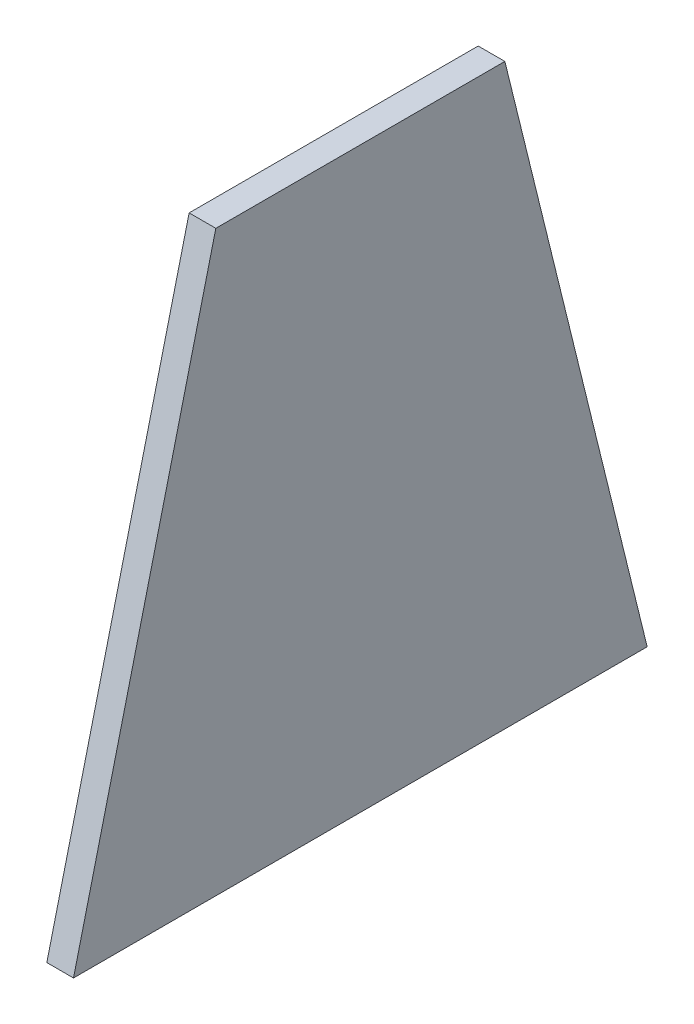
ISO-10303-21;
HEADER;
FILE_DESCRIPTION(('STEP AP214'),'2;1');
FILE_NAME('part.step','',(''),(''),'','','');
FILE_SCHEMA(('AUTOMOTIVE_DESIGN { 1 0 10303 214 1 1 1 1 }'));
ENDSEC;
DATA;
#1=APPLICATION_CONTEXT('core data for automotive mechanical design processes');
#2=APPLICATION_PROTOCOL_DEFINITION('international standard','automotive_design',2000,#1);
#3=PRODUCT_CONTEXT('',#1,'mechanical');
#4=PRODUCT('Part','Part','',(#3));
#5=PRODUCT_RELATED_PRODUCT_CATEGORY('part','',(#4));
#6=PRODUCT_DEFINITION_FORMATION('','',#4);
#7=PRODUCT_DEFINITION_CONTEXT('part definition',#1,'design');
#8=PRODUCT_DEFINITION('design','',#6,#7);
#9=PRODUCT_DEFINITION_SHAPE('','',#8);
#10=(LENGTH_UNIT() NAMED_UNIT(*) SI_UNIT(.MILLI.,.METRE.));
#11=(NAMED_UNIT(*) PLANE_ANGLE_UNIT() SI_UNIT($,.RADIAN.));
#12=(NAMED_UNIT(*) SI_UNIT($,.STERADIAN.) SOLID_ANGLE_UNIT());
#13=UNCERTAINTY_MEASURE_WITH_UNIT(LENGTH_MEASURE(1.E-05),#10,'distance_accuracy_value','');
#14=(GEOMETRIC_REPRESENTATION_CONTEXT(3) GLOBAL_UNCERTAINTY_ASSIGNED_CONTEXT((#13)) GLOBAL_UNIT_ASSIGNED_CONTEXT((#10,
#11,#12)) REPRESENTATION_CONTEXT('',''));
#15=CARTESIAN_POINT('',(0.,0.,0.));
#16=DIRECTION('',(0.,0.,1.));
#17=DIRECTION('',(1.,0.,0.));
#18=AXIS2_PLACEMENT_3D('',#15,#16,#17);
#19=CARTESIAN_POINT('',(3.,-31.5617211464041,31.1057963057904));
#20=DIRECTION('',(0.,-0.239019047122404,-0.971014878934766));
#21=DIRECTION('',(0.,0.971014878934766,-0.239019047122404));
#22=AXIS2_PLACEMENT_3D('',#19,#20,#21);
#23=PLANE('',#22);
#24=DIRECTION('',(0.,-0.971014878934766,0.239019047122404));
#25=VECTOR('',#24,1.);
#26=CARTESIAN_POINT('',(0.,-31.5617211464041,31.1057963057904));
#27=LINE('',#26,#25);
#28=CARTESIAN_POINT('',(0.,33.4382788535959,15.1057963057904));
#29=VERTEX_POINT('',#28);
#30=CARTESIAN_POINT('',(0.,-31.5617211464041,31.1057963057904));
#31=VERTEX_POINT('',#30);
#32=EDGE_CURVE('E107',#29,#31,#27,.T.);
#33=ORIENTED_EDGE('',*,*,#32,.T.);
#34=DIRECTION('',(-1.,0.,0.));
#35=VECTOR('',#34,1.);
#36=CARTESIAN_POINT('',(3.,-31.5617211464041,31.1057963057904));
#37=LINE('',#36,#35);
#38=CARTESIAN_POINT('',(3.,-31.5617211464041,31.1057963057904));
#39=VERTEX_POINT('',#38);
#40=EDGE_CURVE('E11',#39,#31,#37,.T.);
#41=ORIENTED_EDGE('',*,*,#40,.F.);
#42=DIRECTION('',(0.,-0.971014878934766,0.239019047122404));
#43=VECTOR('',#42,1.);
#44=CARTESIAN_POINT('',(3.,-31.5617211464041,31.1057963057904));
#45=LINE('',#44,#43);
#46=CARTESIAN_POINT('',(3.,33.4382788535959,15.1057963057904));
#47=VERTEX_POINT('',#46);
#48=EDGE_CURVE('E91',#47,#39,#45,.T.);
#49=ORIENTED_EDGE('',*,*,#48,.F.);
#50=DIRECTION('',(-1.,0.,0.));
#51=VECTOR('',#50,1.);
#52=CARTESIAN_POINT('',(3.,33.4382788535959,15.1057963057904));
#53=LINE('',#52,#51);
#54=EDGE_CURVE('E103',#47,#29,#53,.T.);
#55=ORIENTED_EDGE('',*,*,#54,.T.);
#56=EDGE_LOOP('',(#33,#41,#49,#55));
#57=FACE_BOUND('',#56,.T.);
#58=ADVANCED_FACE('F39',(#57),#23,.F.);
#59=CARTESIAN_POINT('',(3.,-31.5617211464041,-33.3942036942096));
#60=DIRECTION('',(0.,1.,0.));
#61=DIRECTION('',(0.,0.,1.));
#62=AXIS2_PLACEMENT_3D('',#59,#60,#61);
#63=PLANE('',#62);
#64=DIRECTION('',(0.,0.,-1.));
#65=VECTOR('',#64,1.);
#66=CARTESIAN_POINT('',(0.,-31.5617211464041,-33.3942036942096));
#67=LINE('',#66,#65);
#68=CARTESIAN_POINT('',(0.,-31.5617211464041,-33.3942036942096));
#69=VERTEX_POINT('',#68);
#70=EDGE_CURVE('E96',#31,#69,#67,.T.);
#71=ORIENTED_EDGE('',*,*,#70,.T.);
#72=DIRECTION('',(-1.,0.,0.));
#73=VECTOR('',#72,1.);
#74=CARTESIAN_POINT('',(3.,-31.5617211464041,-33.3942036942096));
#75=LINE('',#74,#73);
#76=CARTESIAN_POINT('',(3.,-31.5617211464041,-33.3942036942096));
#77=VERTEX_POINT('',#76);
#78=EDGE_CURVE('E48',#77,#69,#75,.T.);
#79=ORIENTED_EDGE('',*,*,#78,.F.);
#80=DIRECTION('',(0.,0.,-1.));
#81=VECTOR('',#80,1.);
#82=CARTESIAN_POINT('',(3.,-31.5617211464041,-33.3942036942096));
#83=LINE('',#82,#81);
#84=EDGE_CURVE('E86',#39,#77,#83,.T.);
#85=ORIENTED_EDGE('',*,*,#84,.F.);
#86=ORIENTED_EDGE('',*,*,#40,.T.);
#87=EDGE_LOOP('',(#71,#79,#85,#86));
#88=FACE_BOUND('',#87,.T.);
#89=ADVANCED_FACE('F95',(#88),#63,.F.);
#90=CARTESIAN_POINT('',(3.,33.4382788535959,-17.3942036942096));
#91=DIRECTION('',(0.,-0.239019047122404,0.971014878934766));
#92=DIRECTION('',(0.,-0.971014878934766,-0.239019047122404));
#93=AXIS2_PLACEMENT_3D('',#90,#91,#92);
#94=PLANE('',#93);
#95=DIRECTION('',(0.,0.971014878934766,0.239019047122404));
#96=VECTOR('',#95,1.);
#97=CARTESIAN_POINT('',(0.,33.4382788535959,-17.3942036942096));
#98=LINE('',#97,#96);
#99=CARTESIAN_POINT('',(0.,33.4382788535959,-17.3942036942096));
#100=VERTEX_POINT('',#99);
#101=EDGE_CURVE('E73',#69,#100,#98,.T.);
#102=ORIENTED_EDGE('',*,*,#101,.T.);
#103=DIRECTION('',(-1.,0.,0.));
#104=VECTOR('',#103,1.);
#105=CARTESIAN_POINT('',(3.,33.4382788535959,-17.3942036942096));
#106=LINE('',#105,#104);
#107=CARTESIAN_POINT('',(3.,33.4382788535959,-17.3942036942096));
#108=VERTEX_POINT('',#107);
#109=EDGE_CURVE('E98',#108,#100,#106,.T.);
#110=ORIENTED_EDGE('',*,*,#109,.F.);
#111=DIRECTION('',(0.,0.971014878934766,0.239019047122404));
#112=VECTOR('',#111,1.);
#113=CARTESIAN_POINT('',(3.,33.4382788535959,-17.3942036942096));
#114=LINE('',#113,#112);
#115=EDGE_CURVE('E89',#77,#108,#114,.T.);
#116=ORIENTED_EDGE('',*,*,#115,.F.);
#117=ORIENTED_EDGE('',*,*,#78,.T.);
#118=EDGE_LOOP('',(#102,#110,#116,#117));
#119=FACE_BOUND('',#118,.T.);
#120=ADVANCED_FACE('F99',(#119),#94,.F.);
#121=CARTESIAN_POINT('',(3.,33.4382788535959,15.1057963057904));
#122=DIRECTION('',(0.,-1.,0.));
#123=DIRECTION('',(0.,0.,-1.));
#124=AXIS2_PLACEMENT_3D('',#121,#122,#123);
#125=PLANE('',#124);
#126=DIRECTION('',(0.,0.,1.));
#127=VECTOR('',#126,1.);
#128=CARTESIAN_POINT('',(0.,33.4382788535959,15.1057963057904));
#129=LINE('',#128,#127);
#130=EDGE_CURVE('E79',#100,#29,#129,.T.);
#131=ORIENTED_EDGE('',*,*,#130,.T.);
#132=ORIENTED_EDGE('',*,*,#54,.F.);
#133=DIRECTION('',(0.,0.,1.));
#134=VECTOR('',#133,1.);
#135=CARTESIAN_POINT('',(3.,33.4382788535959,15.1057963057904));
#136=LINE('',#135,#134);
#137=EDGE_CURVE('E56',#108,#47,#136,.T.);
#138=ORIENTED_EDGE('',*,*,#137,.F.);
#139=ORIENTED_EDGE('',*,*,#109,.T.);
#140=EDGE_LOOP('',(#131,#132,#138,#139));
#141=FACE_BOUND('',#140,.T.);
#142=ADVANCED_FACE('F120',(#141),#125,.F.);
#143=CARTESIAN_POINT('',(3.,0.,0.));
#144=DIRECTION('',(-1.,0.,0.));
#145=DIRECTION('',(0.,0.,1.));
#146=AXIS2_PLACEMENT_3D('',#143,#144,#145);
#147=PLANE('',#146);
#148=ORIENTED_EDGE('',*,*,#48,.T.);
#149=ORIENTED_EDGE('',*,*,#84,.T.);
#150=ORIENTED_EDGE('',*,*,#115,.T.);
#151=ORIENTED_EDGE('',*,*,#137,.T.);
#152=EDGE_LOOP('',(#148,#149,#150,#151));
#153=FACE_BOUND('',#152,.T.);
#154=ADVANCED_FACE('F87',(#153),#147,.F.);
#155=CARTESIAN_POINT('',(0.,0.,0.));
#156=DIRECTION('',(-1.,0.,0.));
#157=DIRECTION('',(0.,0.,1.));
#158=AXIS2_PLACEMENT_3D('',#155,#156,#157);
#159=PLANE('',#158);
#160=ORIENTED_EDGE('',*,*,#32,.F.);
#161=ORIENTED_EDGE('',*,*,#130,.F.);
#162=ORIENTED_EDGE('',*,*,#101,.F.);
#163=ORIENTED_EDGE('',*,*,#70,.F.);
#164=EDGE_LOOP('',(#160,#161,#162,#163));
#165=FACE_BOUND('',#164,.T.);
#166=ADVANCED_FACE('F123',(#165),#159,.T.);
#167=CLOSED_SHELL('',(#58,#89,#120,#142,#154,#166));
#168=MANIFOLD_SOLID_BREP('B2',#167);
#169=ADVANCED_BREP_SHAPE_REPRESENTATION('',(#18,#168),#14);
#170=SHAPE_DEFINITION_REPRESENTATION(#9,#169);
ENDSEC;
END-ISO-10303-21;
